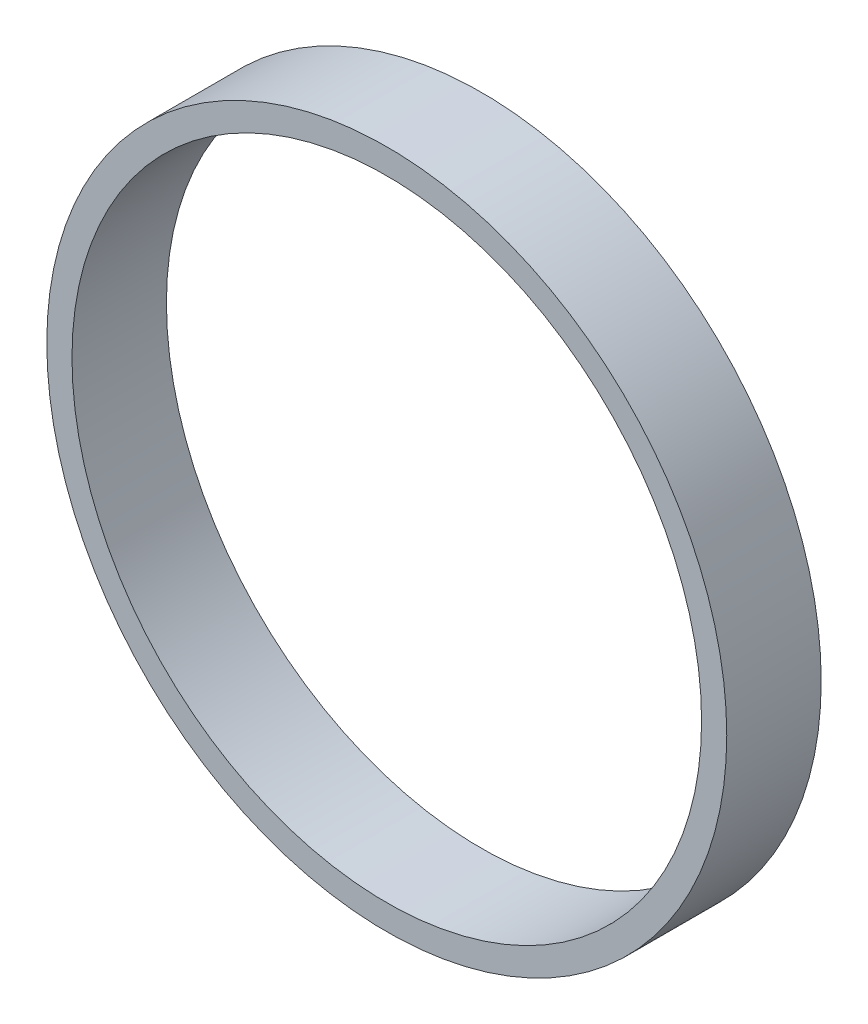
ISO-10303-21;
HEADER;
FILE_DESCRIPTION(('STEP AP214'),'2;1');
FILE_NAME('part.step','',(''),(''),'','','');
FILE_SCHEMA(('AUTOMOTIVE_DESIGN { 1 0 10303 214 1 1 1 1 }'));
ENDSEC;
DATA;
#1=APPLICATION_CONTEXT('core data for automotive mechanical design processes');
#2=APPLICATION_PROTOCOL_DEFINITION('international standard','automotive_design',2000,#1);
#3=PRODUCT_CONTEXT('',#1,'mechanical');
#4=PRODUCT('Part','Part','',(#3));
#5=PRODUCT_RELATED_PRODUCT_CATEGORY('part','',(#4));
#6=PRODUCT_DEFINITION_FORMATION('','',#4);
#7=PRODUCT_DEFINITION_CONTEXT('part definition',#1,'design');
#8=PRODUCT_DEFINITION('design','',#6,#7);
#9=PRODUCT_DEFINITION_SHAPE('','',#8);
#10=(LENGTH_UNIT() NAMED_UNIT(*) SI_UNIT(.MILLI.,.METRE.));
#11=(NAMED_UNIT(*) PLANE_ANGLE_UNIT() SI_UNIT($,.RADIAN.));
#12=(NAMED_UNIT(*) SI_UNIT($,.STERADIAN.) SOLID_ANGLE_UNIT());
#13=UNCERTAINTY_MEASURE_WITH_UNIT(LENGTH_MEASURE(1.E-05),#10,'distance_accuracy_value','');
#14=(GEOMETRIC_REPRESENTATION_CONTEXT(3) GLOBAL_UNCERTAINTY_ASSIGNED_CONTEXT((#13)) GLOBAL_UNIT_ASSIGNED_CONTEXT((#10,
#11,#12)) REPRESENTATION_CONTEXT('',''));
#15=CARTESIAN_POINT('',(0.,0.,0.));
#16=DIRECTION('',(0.,0.,1.));
#17=DIRECTION('',(1.,0.,0.));
#18=AXIS2_PLACEMENT_3D('',#15,#16,#17);
#19=CARTESIAN_POINT('',(0.,0.,15.));
#20=DIRECTION('',(0.,0.,1.));
#21=DIRECTION('',(1.,0.,0.));
#22=AXIS2_PLACEMENT_3D('',#19,#20,#21);
#23=PLANE('',#22);
#24=CARTESIAN_POINT('',(0.,0.,15.));
#25=DIRECTION('',(0.,0.,1.));
#26=DIRECTION('',(1.,0.,0.));
#27=AXIS2_PLACEMENT_3D('',#24,#25,#26);
#28=CIRCLE('',#27,54.);
#29=CARTESIAN_POINT('',(54.,0.,15.));
#30=VERTEX_POINT('',#29);
#31=EDGE_CURVE('E10',#30,#30,#28,.T.);
#32=ORIENTED_EDGE('',*,*,#31,.T.);
#33=EDGE_LOOP('',(#32));
#34=FACE_BOUND('',#33,.T.);
#35=CARTESIAN_POINT('',(0.,0.,15.));
#36=DIRECTION('',(0.,0.,1.));
#37=DIRECTION('',(1.,0.,0.));
#38=AXIS2_PLACEMENT_3D('',#35,#36,#37);
#39=CIRCLE('',#38,50.);
#40=CARTESIAN_POINT('',(50.,0.,15.));
#41=VERTEX_POINT('',#40);
#42=EDGE_CURVE('E41',#41,#41,#39,.T.);
#43=ORIENTED_EDGE('',*,*,#42,.F.);
#44=EDGE_LOOP('',(#43));
#45=FACE_BOUND('',#44,.T.);
#46=ADVANCED_FACE('F30',(#34,#45),#23,.T.);
#47=CARTESIAN_POINT('',(0.,0.,0.));
#48=DIRECTION('',(0.,0.,1.));
#49=DIRECTION('',(1.,0.,0.));
#50=AXIS2_PLACEMENT_3D('',#47,#48,#49);
#51=PLANE('',#50);
#52=CARTESIAN_POINT('',(0.,0.,0.));
#53=DIRECTION('',(0.,0.,1.));
#54=DIRECTION('',(1.,0.,0.));
#55=AXIS2_PLACEMENT_3D('',#52,#53,#54);
#56=CIRCLE('',#55,54.);
#57=CARTESIAN_POINT('',(54.,0.,0.));
#58=VERTEX_POINT('',#57);
#59=EDGE_CURVE('E34',#58,#58,#56,.T.);
#60=ORIENTED_EDGE('',*,*,#59,.F.);
#61=EDGE_LOOP('',(#60));
#62=FACE_BOUND('',#61,.T.);
#63=CARTESIAN_POINT('',(0.,0.,0.));
#64=DIRECTION('',(0.,0.,1.));
#65=DIRECTION('',(1.,0.,0.));
#66=AXIS2_PLACEMENT_3D('',#63,#64,#65);
#67=CIRCLE('',#66,50.);
#68=CARTESIAN_POINT('',(50.,0.,0.));
#69=VERTEX_POINT('',#68);
#70=EDGE_CURVE('E43',#69,#69,#67,.T.);
#71=ORIENTED_EDGE('',*,*,#70,.T.);
#72=EDGE_LOOP('',(#71));
#73=FACE_BOUND('',#72,.T.);
#74=ADVANCED_FACE('F53',(#62,#73),#51,.F.);
#75=CARTESIAN_POINT('',(0.,0.,15.));
#76=DIRECTION('',(0.,0.,-1.));
#77=DIRECTION('',(-1.,0.,0.));
#78=AXIS2_PLACEMENT_3D('',#75,#76,#77);
#79=CYLINDRICAL_SURFACE('',#78,54.);
#80=ORIENTED_EDGE('',*,*,#31,.F.);
#81=EDGE_LOOP('',(#80));
#82=FACE_BOUND('',#81,.T.);
#83=ORIENTED_EDGE('',*,*,#59,.T.);
#84=EDGE_LOOP('',(#83));
#85=FACE_BOUND('',#84,.T.);
#86=ADVANCED_FACE('F32',(#82,#85),#79,.T.);
#87=CARTESIAN_POINT('',(0.,0.,15.));
#88=DIRECTION('',(0.,0.,-1.));
#89=DIRECTION('',(-1.,0.,0.));
#90=AXIS2_PLACEMENT_3D('',#87,#88,#89);
#91=CYLINDRICAL_SURFACE('',#90,50.);
#92=ORIENTED_EDGE('',*,*,#42,.T.);
#93=EDGE_LOOP('',(#92));
#94=FACE_BOUND('',#93,.T.);
#95=ORIENTED_EDGE('',*,*,#70,.F.);
#96=EDGE_LOOP('',(#95));
#97=FACE_BOUND('',#96,.T.);
#98=ADVANCED_FACE('F49',(#94,#97),#91,.F.);
#99=CLOSED_SHELL('',(#46,#74,#86,#98));
#100=MANIFOLD_SOLID_BREP('B2',#99);
#101=ADVANCED_BREP_SHAPE_REPRESENTATION('',(#18,#100),#14);
#102=SHAPE_DEFINITION_REPRESENTATION(#9,#101);
ENDSEC;
END-ISO-10303-21;
